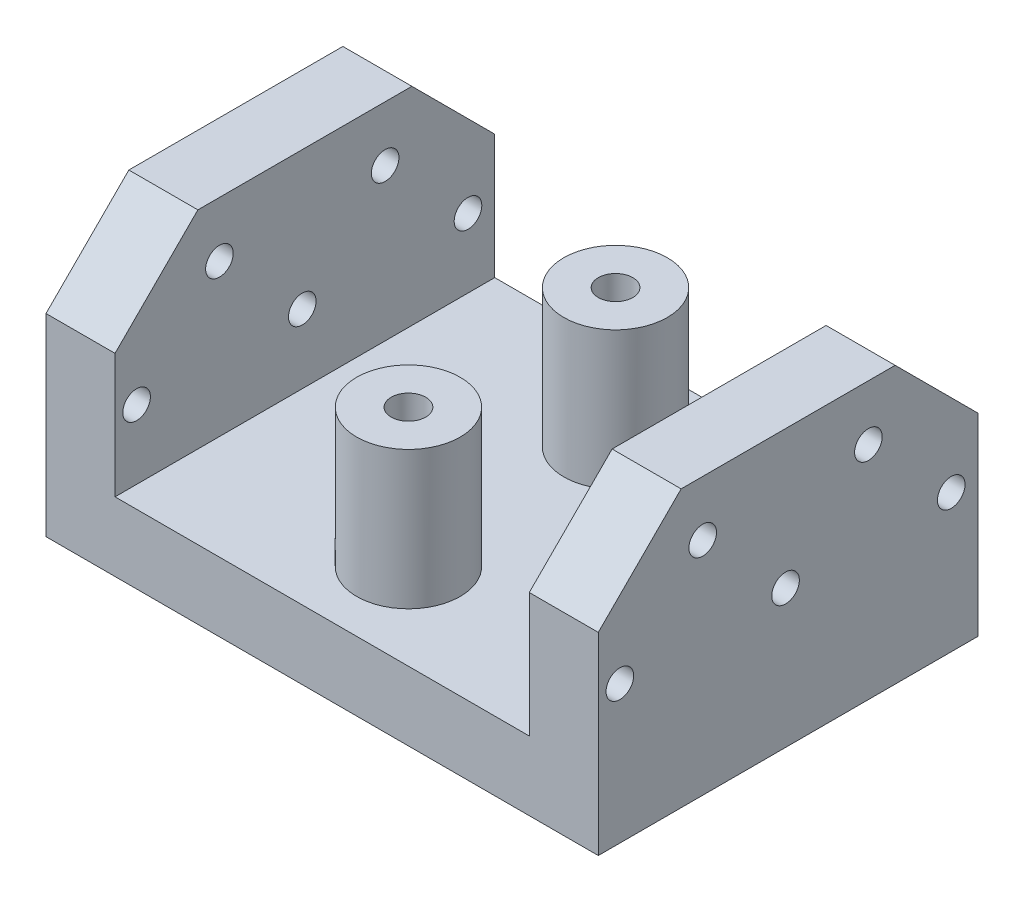
ISO-10303-21;
HEADER;
FILE_DESCRIPTION(('STEP AP214'),'2;1');
FILE_NAME('part.step','',(''),(''),'','','');
FILE_SCHEMA(('AUTOMOTIVE_DESIGN { 1 0 10303 214 1 1 1 1 }'));
ENDSEC;
DATA;
#1=APPLICATION_CONTEXT('core data for automotive mechanical design processes');
#2=APPLICATION_PROTOCOL_DEFINITION('international standard','automotive_design',2000,#1);
#3=PRODUCT_CONTEXT('',#1,'mechanical');
#4=PRODUCT('Part','Part','',(#3));
#5=PRODUCT_RELATED_PRODUCT_CATEGORY('part','',(#4));
#6=PRODUCT_DEFINITION_FORMATION('','',#4);
#7=PRODUCT_DEFINITION_CONTEXT('part definition',#1,'design');
#8=PRODUCT_DEFINITION('design','',#6,#7);
#9=PRODUCT_DEFINITION_SHAPE('','',#8);
#10=(LENGTH_UNIT() NAMED_UNIT(*) SI_UNIT(.MILLI.,.METRE.));
#11=(NAMED_UNIT(*) PLANE_ANGLE_UNIT() SI_UNIT($,.RADIAN.));
#12=(NAMED_UNIT(*) SI_UNIT($,.STERADIAN.) SOLID_ANGLE_UNIT());
#13=UNCERTAINTY_MEASURE_WITH_UNIT(LENGTH_MEASURE(1.E-05),#10,'distance_accuracy_value','');
#14=(GEOMETRIC_REPRESENTATION_CONTEXT(3) GLOBAL_UNCERTAINTY_ASSIGNED_CONTEXT((#13)) GLOBAL_UNIT_ASSIGNED_CONTEXT((#10,
#11,#12)) REPRESENTATION_CONTEXT('',''));
#15=CARTESIAN_POINT('',(0.,0.,0.));
#16=DIRECTION('',(0.,0.,1.));
#17=DIRECTION('',(1.,0.,0.));
#18=AXIS2_PLACEMENT_3D('',#15,#16,#17);
#19=CARTESIAN_POINT('',(0.,10.,0.));
#20=DIRECTION('',(0.,-1.,0.));
#21=DIRECTION('',(0.,0.,-1.));
#22=AXIS2_PLACEMENT_3D('',#19,#20,#21);
#23=PLANE('',#22);
#24=CARTESIAN_POINT('',(0.,10.,-15.));
#25=DIRECTION('',(0.,-1.,0.));
#26=DIRECTION('',(0.,0.,-1.));
#27=AXIS2_PLACEMENT_3D('',#24,#25,#26);
#28=CIRCLE('',#27,7.5);
#29=CARTESIAN_POINT('',(0.,10.,-22.5));
#30=VERTEX_POINT('',#29);
#31=EDGE_CURVE('E198',#30,#30,#28,.F.);
#32=ORIENTED_EDGE('',*,*,#31,.F.);
#33=EDGE_LOOP('',(#32));
#34=FACE_BOUND('',#33,.T.);
#35=DIRECTION('',(0.,0.,1.));
#36=VECTOR('',#35,1.);
#37=CARTESIAN_POINT('',(30.,10.,-27.5));
#38=LINE('',#37,#36);
#39=CARTESIAN_POINT('',(30.,10.,-27.5));
#40=VERTEX_POINT('',#39);
#41=CARTESIAN_POINT('',(30.,10.,27.5));
#42=VERTEX_POINT('',#41);
#43=EDGE_CURVE('E247',#40,#42,#38,.T.);
#44=ORIENTED_EDGE('',*,*,#43,.F.);
#45=DIRECTION('',(-1.,0.,0.));
#46=VECTOR('',#45,1.);
#47=CARTESIAN_POINT('',(-40.,10.,-27.5));
#48=LINE('',#47,#46);
#49=CARTESIAN_POINT('',(-30.,10.,-27.5));
#50=VERTEX_POINT('',#49);
#51=EDGE_CURVE('E271',#40,#50,#48,.T.);
#52=ORIENTED_EDGE('',*,*,#51,.T.);
#53=DIRECTION('',(0.,0.,-1.));
#54=VECTOR('',#53,1.);
#55=CARTESIAN_POINT('',(-30.,10.,-27.5));
#56=LINE('',#55,#54);
#57=CARTESIAN_POINT('',(-30.,10.,27.5));
#58=VERTEX_POINT('',#57);
#59=EDGE_CURVE('E259',#58,#50,#56,.T.);
#60=ORIENTED_EDGE('',*,*,#59,.F.);
#61=DIRECTION('',(1.,0.,0.));
#62=VECTOR('',#61,1.);
#63=CARTESIAN_POINT('',(-40.,10.,27.5));
#64=LINE('',#63,#62);
#65=EDGE_CURVE('E274',#58,#42,#64,.T.);
#66=ORIENTED_EDGE('',*,*,#65,.T.);
#67=EDGE_LOOP('',(#44,#52,#60,#66));
#68=FACE_BOUND('',#67,.T.);
#69=CARTESIAN_POINT('',(0.,10.,15.));
#70=DIRECTION('',(0.,-1.,0.));
#71=DIRECTION('',(0.,0.,-1.));
#72=AXIS2_PLACEMENT_3D('',#69,#70,#71);
#73=CIRCLE('',#72,7.5);
#74=CARTESIAN_POINT('',(0.,10.,7.5));
#75=VERTEX_POINT('',#74);
#76=EDGE_CURVE('E228',#75,#75,#73,.F.);
#77=ORIENTED_EDGE('',*,*,#76,.F.);
#78=EDGE_LOOP('',(#77));
#79=FACE_BOUND('',#78,.T.);
#80=ADVANCED_FACE('F37',(#34,#68,#79),#23,.F.);
#81=CARTESIAN_POINT('',(40.,10.,27.5));
#82=DIRECTION('',(-1.,0.,0.));
#83=DIRECTION('',(0.,0.,1.));
#84=AXIS2_PLACEMENT_3D('',#81,#82,#83);
#85=PLANE('',#84);
#86=CARTESIAN_POINT('',(40.,20.,0.3758071990035));
#87=DIRECTION('',(-1.,0.,0.));
#88=DIRECTION('',(0.,0.,1.));
#89=AXIS2_PLACEMENT_3D('',#86,#87,#88);
#90=CIRCLE('',#89,2.);
#91=CARTESIAN_POINT('',(40.,20.,2.3758071990035));
#92=VERTEX_POINT('',#91);
#93=EDGE_CURVE('E213',#92,#92,#90,.T.);
#94=ORIENTED_EDGE('',*,*,#93,.T.);
#95=EDGE_LOOP('',(#94));
#96=FACE_BOUND('',#95,.T.);
#97=CARTESIAN_POINT('',(40.,20.,24.3758071990035));
#98=DIRECTION('',(-1.,0.,0.));
#99=DIRECTION('',(0.,0.,1.));
#100=AXIS2_PLACEMENT_3D('',#97,#98,#99);
#101=CIRCLE('',#100,2.);
#102=CARTESIAN_POINT('',(40.,20.,26.3758071990035));
#103=VERTEX_POINT('',#102);
#104=EDGE_CURVE('E400',#103,#103,#101,.T.);
#105=ORIENTED_EDGE('',*,*,#104,.T.);
#106=EDGE_LOOP('',(#105));
#107=FACE_BOUND('',#106,.T.);
#108=CARTESIAN_POINT('',(40.,32.,-11.6241928009965));
#109=DIRECTION('',(-1.,0.,0.));
#110=DIRECTION('',(0.,0.,1.));
#111=AXIS2_PLACEMENT_3D('',#108,#109,#110);
#112=CIRCLE('',#111,2.);
#113=CARTESIAN_POINT('',(40.,32.,-9.6241928009965));
#114=VERTEX_POINT('',#113);
#115=EDGE_CURVE('E406',#114,#114,#112,.T.);
#116=ORIENTED_EDGE('',*,*,#115,.T.);
#117=EDGE_LOOP('',(#116));
#118=FACE_BOUND('',#117,.T.);
#119=CARTESIAN_POINT('',(40.,32.,12.3758071990035));
#120=DIRECTION('',(-1.,0.,0.));
#121=DIRECTION('',(0.,0.,1.));
#122=AXIS2_PLACEMENT_3D('',#119,#120,#121);
#123=CIRCLE('',#122,2.);
#124=CARTESIAN_POINT('',(40.,32.,14.3758071990035));
#125=VERTEX_POINT('',#124);
#126=EDGE_CURVE('E412',#125,#125,#123,.T.);
#127=ORIENTED_EDGE('',*,*,#126,.T.);
#128=EDGE_LOOP('',(#127));
#129=FACE_BOUND('',#128,.T.);
#130=CARTESIAN_POINT('',(40.,20.,-23.6241928009965));
#131=DIRECTION('',(-1.,0.,0.));
#132=DIRECTION('',(0.,0.,1.));
#133=AXIS2_PLACEMENT_3D('',#130,#131,#132);
#134=CIRCLE('',#133,2.);
#135=CARTESIAN_POINT('',(40.,20.,-21.6241928009965));
#136=VERTEX_POINT('',#135);
#137=EDGE_CURVE('E208',#136,#136,#134,.T.);
#138=ORIENTED_EDGE('',*,*,#137,.T.);
#139=EDGE_LOOP('',(#138));
#140=FACE_BOUND('',#139,.T.);
#141=DIRECTION('',(0.,-1.,0.));
#142=VECTOR('',#141,1.);
#143=CARTESIAN_POINT('',(40.,10.,-27.5));
#144=LINE('',#143,#142);
#145=CARTESIAN_POINT('',(40.,28.,-27.5));
#146=VERTEX_POINT('',#145);
#147=CARTESIAN_POINT('',(40.,0.,-27.5));
#148=VERTEX_POINT('',#147);
#149=EDGE_CURVE('E195',#146,#148,#144,.T.);
#150=ORIENTED_EDGE('',*,*,#149,.F.);
#151=DIRECTION('',(0.,-0.707106781186548,-0.707106781186548));
#152=VECTOR('',#151,1.);
#153=CARTESIAN_POINT('',(40.,40.,-15.5));
#154=LINE('',#153,#152);
#155=CARTESIAN_POINT('',(40.,40.,-15.5));
#156=VERTEX_POINT('',#155);
#157=EDGE_CURVE('E189',#156,#146,#154,.T.);
#158=ORIENTED_EDGE('',*,*,#157,.F.);
#159=DIRECTION('',(0.,0.,-1.));
#160=VECTOR('',#159,1.);
#161=CARTESIAN_POINT('',(40.,40.,-27.5));
#162=LINE('',#161,#160);
#163=CARTESIAN_POINT('',(40.,40.,15.5));
#164=VERTEX_POINT('',#163);
#165=EDGE_CURVE('E236',#164,#156,#162,.T.);
#166=ORIENTED_EDGE('',*,*,#165,.F.);
#167=DIRECTION('',(0.,0.707106781186548,-0.707106781186548));
#168=VECTOR('',#167,1.);
#169=CARTESIAN_POINT('',(40.,28.,27.5));
#170=LINE('',#169,#168);
#171=CARTESIAN_POINT('',(40.,28.,27.5));
#172=VERTEX_POINT('',#171);
#173=EDGE_CURVE('E245',#172,#164,#170,.T.);
#174=ORIENTED_EDGE('',*,*,#173,.F.);
#175=DIRECTION('',(0.,-1.,0.));
#176=VECTOR('',#175,1.);
#177=CARTESIAN_POINT('',(40.,10.,27.5));
#178=LINE('',#177,#176);
#179=CARTESIAN_POINT('',(40.,0.,27.5));
#180=VERTEX_POINT('',#179);
#181=EDGE_CURVE('E200',#172,#180,#178,.T.);
#182=ORIENTED_EDGE('',*,*,#181,.T.);
#183=DIRECTION('',(0.,0.,-1.));
#184=VECTOR('',#183,1.);
#185=CARTESIAN_POINT('',(40.,0.,27.5));
#186=LINE('',#185,#184);
#187=EDGE_CURVE('E270',#180,#148,#186,.T.);
#188=ORIENTED_EDGE('',*,*,#187,.T.);
#189=EDGE_LOOP('',(#150,#158,#166,#174,#182,#188));
#190=FACE_BOUND('',#189,.T.);
#191=ADVANCED_FACE('F39',(#96,#107,#118,#129,#140,#190),#85,.F.);
#192=CARTESIAN_POINT('',(-40.,10.,-27.5));
#193=DIRECTION('',(0.,0.,1.));
#194=DIRECTION('',(1.,0.,0.));
#195=AXIS2_PLACEMENT_3D('',#192,#193,#194);
#196=PLANE('',#195);
#197=DIRECTION('',(0.,-1.,0.));
#198=VECTOR('',#197,1.);
#199=CARTESIAN_POINT('',(-40.,10.,-27.5));
#200=LINE('',#199,#198);
#201=CARTESIAN_POINT('',(-40.,28.,-27.5));
#202=VERTEX_POINT('',#201);
#203=CARTESIAN_POINT('',(-40.,0.,-27.5));
#204=VERTEX_POINT('',#203);
#205=EDGE_CURVE('E184',#202,#204,#200,.T.);
#206=ORIENTED_EDGE('',*,*,#205,.F.);
#207=DIRECTION('',(1.,0.,0.));
#208=VECTOR('',#207,1.);
#209=CARTESIAN_POINT('',(-40.,28.,-27.5));
#210=LINE('',#209,#208);
#211=CARTESIAN_POINT('',(-30.,28.,-27.5));
#212=VERTEX_POINT('',#211);
#213=EDGE_CURVE('E171',#202,#212,#210,.T.);
#214=ORIENTED_EDGE('',*,*,#213,.T.);
#215=DIRECTION('',(0.,-1.,0.));
#216=VECTOR('',#215,1.);
#217=CARTESIAN_POINT('',(-30.,40.,-27.5));
#218=LINE('',#217,#216);
#219=EDGE_CURVE('E264',#212,#50,#218,.T.);
#220=ORIENTED_EDGE('',*,*,#219,.T.);
#221=ORIENTED_EDGE('',*,*,#51,.F.);
#222=DIRECTION('',(0.,-1.,0.));
#223=VECTOR('',#222,1.);
#224=CARTESIAN_POINT('',(30.,40.,-27.5));
#225=LINE('',#224,#223);
#226=CARTESIAN_POINT('',(30.,28.,-27.5));
#227=VERTEX_POINT('',#226);
#228=EDGE_CURVE('E257',#227,#40,#225,.T.);
#229=ORIENTED_EDGE('',*,*,#228,.F.);
#230=EDGE_CURVE('E178',#227,#146,#210,.T.);
#231=ORIENTED_EDGE('',*,*,#230,.T.);
#232=ORIENTED_EDGE('',*,*,#149,.T.);
#233=DIRECTION('',(-1.,0.,0.));
#234=VECTOR('',#233,1.);
#235=CARTESIAN_POINT('',(-40.,0.,-27.5));
#236=LINE('',#235,#234);
#237=EDGE_CURVE('E193',#148,#204,#236,.T.);
#238=ORIENTED_EDGE('',*,*,#237,.T.);
#239=EDGE_LOOP('',(#206,#214,#220,#221,#229,#231,#232,#238));
#240=FACE_BOUND('',#239,.T.);
#241=ADVANCED_FACE('F191',(#240),#196,.F.);
#242=CARTESIAN_POINT('',(-40.,10.,27.5));
#243=DIRECTION('',(1.,0.,0.));
#244=DIRECTION('',(0.,0.,-1.));
#245=AXIS2_PLACEMENT_3D('',#242,#243,#244);
#246=PLANE('',#245);
#247=CARTESIAN_POINT('',(-40.,20.,0.3758071990035));
#248=DIRECTION('',(-1.,0.,0.));
#249=DIRECTION('',(0.,0.,1.));
#250=AXIS2_PLACEMENT_3D('',#247,#248,#249);
#251=CIRCLE('',#250,2.);
#252=CARTESIAN_POINT('',(-40.,20.,2.3758071990035));
#253=VERTEX_POINT('',#252);
#254=EDGE_CURVE('E397',#253,#253,#251,.T.);
#255=ORIENTED_EDGE('',*,*,#254,.F.);
#256=EDGE_LOOP('',(#255));
#257=FACE_BOUND('',#256,.T.);
#258=CARTESIAN_POINT('',(-40.,20.,24.3758071990035));
#259=DIRECTION('',(-1.,0.,0.));
#260=DIRECTION('',(0.,0.,1.));
#261=AXIS2_PLACEMENT_3D('',#258,#259,#260);
#262=CIRCLE('',#261,2.);
#263=CARTESIAN_POINT('',(-40.,20.,26.3758071990035));
#264=VERTEX_POINT('',#263);
#265=EDGE_CURVE('E403',#264,#264,#262,.T.);
#266=ORIENTED_EDGE('',*,*,#265,.F.);
#267=EDGE_LOOP('',(#266));
#268=FACE_BOUND('',#267,.T.);
#269=CARTESIAN_POINT('',(-40.,32.,-11.6241928009965));
#270=DIRECTION('',(-1.,0.,0.));
#271=DIRECTION('',(0.,0.,1.));
#272=AXIS2_PLACEMENT_3D('',#269,#270,#271);
#273=CIRCLE('',#272,2.);
#274=CARTESIAN_POINT('',(-40.,32.,-9.6241928009965));
#275=VERTEX_POINT('',#274);
#276=EDGE_CURVE('E409',#275,#275,#273,.T.);
#277=ORIENTED_EDGE('',*,*,#276,.F.);
#278=EDGE_LOOP('',(#277));
#279=FACE_BOUND('',#278,.T.);
#280=CARTESIAN_POINT('',(-40.,32.,12.3758071990035));
#281=DIRECTION('',(-1.,0.,0.));
#282=DIRECTION('',(0.,0.,1.));
#283=AXIS2_PLACEMENT_3D('',#280,#281,#282);
#284=CIRCLE('',#283,2.);
#285=CARTESIAN_POINT('',(-40.,32.,14.3758071990035));
#286=VERTEX_POINT('',#285);
#287=EDGE_CURVE('E394',#286,#286,#284,.T.);
#288=ORIENTED_EDGE('',*,*,#287,.F.);
#289=EDGE_LOOP('',(#288));
#290=FACE_BOUND('',#289,.T.);
#291=CARTESIAN_POINT('',(-40.,20.,-23.6241928009965));
#292=DIRECTION('',(-1.,0.,0.));
#293=DIRECTION('',(0.,0.,1.));
#294=AXIS2_PLACEMENT_3D('',#291,#292,#293);
#295=CIRCLE('',#294,2.);
#296=CARTESIAN_POINT('',(-40.,20.,-21.6241928009965));
#297=VERTEX_POINT('',#296);
#298=EDGE_CURVE('E425',#297,#297,#295,.T.);
#299=ORIENTED_EDGE('',*,*,#298,.F.);
#300=EDGE_LOOP('',(#299));
#301=FACE_BOUND('',#300,.T.);
#302=DIRECTION('',(0.,0.,1.));
#303=VECTOR('',#302,1.);
#304=CARTESIAN_POINT('',(-40.,40.,-27.5));
#305=LINE('',#304,#303);
#306=CARTESIAN_POINT('',(-40.,40.,-15.5));
#307=VERTEX_POINT('',#306);
#308=CARTESIAN_POINT('',(-40.,40.,15.5));
#309=VERTEX_POINT('',#308);
#310=EDGE_CURVE('E187',#307,#309,#305,.T.);
#311=ORIENTED_EDGE('',*,*,#310,.F.);
#312=DIRECTION('',(0.,-0.707106781186548,-0.707106781186548));
#313=VECTOR('',#312,1.);
#314=CARTESIAN_POINT('',(-40.,40.,-15.5));
#315=LINE('',#314,#313);
#316=EDGE_CURVE('E52',#307,#202,#315,.T.);
#317=ORIENTED_EDGE('',*,*,#316,.T.);
#318=ORIENTED_EDGE('',*,*,#205,.T.);
#319=DIRECTION('',(0.,0.,1.));
#320=VECTOR('',#319,1.);
#321=CARTESIAN_POINT('',(-40.,0.,27.5));
#322=LINE('',#321,#320);
#323=CARTESIAN_POINT('',(-40.,0.,27.5));
#324=VERTEX_POINT('',#323);
#325=EDGE_CURVE('E281',#204,#324,#322,.T.);
#326=ORIENTED_EDGE('',*,*,#325,.T.);
#327=DIRECTION('',(0.,-1.,0.));
#328=VECTOR('',#327,1.);
#329=CARTESIAN_POINT('',(-40.,10.,27.5));
#330=LINE('',#329,#328);
#331=CARTESIAN_POINT('',(-40.,28.,27.5));
#332=VERTEX_POINT('',#331);
#333=EDGE_CURVE('E196',#332,#324,#330,.T.);
#334=ORIENTED_EDGE('',*,*,#333,.F.);
#335=DIRECTION('',(0.,0.707106781186548,-0.707106781186548));
#336=VECTOR('',#335,1.);
#337=CARTESIAN_POINT('',(-40.,28.,27.5));
#338=LINE('',#337,#336);
#339=EDGE_CURVE('E293',#332,#309,#338,.T.);
#340=ORIENTED_EDGE('',*,*,#339,.T.);
#341=EDGE_LOOP('',(#311,#317,#318,#326,#334,#340));
#342=FACE_BOUND('',#341,.T.);
#343=ADVANCED_FACE('F182',(#257,#268,#279,#290,#301,#342),#246,.F.);
#344=CARTESIAN_POINT('',(-40.,10.,27.5));
#345=DIRECTION('',(0.,0.,-1.));
#346=DIRECTION('',(-1.,0.,0.));
#347=AXIS2_PLACEMENT_3D('',#344,#345,#346);
#348=PLANE('',#347);
#349=ORIENTED_EDGE('',*,*,#181,.F.);
#350=DIRECTION('',(1.,0.,0.));
#351=VECTOR('',#350,1.);
#352=CARTESIAN_POINT('',(-40.,28.,27.5));
#353=LINE('',#352,#351);
#354=CARTESIAN_POINT('',(30.,28.,27.5));
#355=VERTEX_POINT('',#354);
#356=EDGE_CURVE('E296',#355,#172,#353,.T.);
#357=ORIENTED_EDGE('',*,*,#356,.F.);
#358=DIRECTION('',(0.,-1.,0.));
#359=VECTOR('',#358,1.);
#360=CARTESIAN_POINT('',(30.,40.,27.5));
#361=LINE('',#360,#359);
#362=EDGE_CURVE('E249',#355,#42,#361,.T.);
#363=ORIENTED_EDGE('',*,*,#362,.T.);
#364=ORIENTED_EDGE('',*,*,#65,.F.);
#365=DIRECTION('',(0.,-1.,0.));
#366=VECTOR('',#365,1.);
#367=CARTESIAN_POINT('',(-30.,40.,27.5));
#368=LINE('',#367,#366);
#369=CARTESIAN_POINT('',(-30.,28.,27.5));
#370=VERTEX_POINT('',#369);
#371=EDGE_CURVE('E268',#370,#58,#368,.T.);
#372=ORIENTED_EDGE('',*,*,#371,.F.);
#373=EDGE_CURVE('E298',#332,#370,#353,.T.);
#374=ORIENTED_EDGE('',*,*,#373,.F.);
#375=ORIENTED_EDGE('',*,*,#333,.T.);
#376=DIRECTION('',(1.,0.,0.));
#377=VECTOR('',#376,1.);
#378=CARTESIAN_POINT('',(-40.,0.,27.5));
#379=LINE('',#378,#377);
#380=EDGE_CURVE('E275',#324,#180,#379,.T.);
#381=ORIENTED_EDGE('',*,*,#380,.T.);
#382=EDGE_LOOP('',(#349,#357,#363,#364,#372,#374,#375,#381));
#383=FACE_BOUND('',#382,.T.);
#384=ADVANCED_FACE('F288',(#383),#348,.F.);
#385=CARTESIAN_POINT('',(0.,0.,0.));
#386=DIRECTION('',(0.,-1.,0.));
#387=DIRECTION('',(0.,0.,-1.));
#388=AXIS2_PLACEMENT_3D('',#385,#386,#387);
#389=PLANE('',#388);
#390=DIRECTION('',(0.,0.,-1.));
#391=VECTOR('',#390,1.);
#392=CARTESIAN_POINT('',(-10.25,0.,-10.75));
#393=LINE('',#392,#391);
#394=CARTESIAN_POINT('',(-10.25,0.,-7.5));
#395=VERTEX_POINT('',#394);
#396=CARTESIAN_POINT('',(-10.25,0.,-10.75));
#397=VERTEX_POINT('',#396);
#398=EDGE_CURVE('E312',#395,#397,#393,.T.);
#399=ORIENTED_EDGE('',*,*,#398,.F.);
#400=DIRECTION('',(-1.,0.,0.));
#401=VECTOR('',#400,1.);
#402=CARTESIAN_POINT('',(-10.25,0.,-7.5));
#403=LINE('',#402,#401);
#404=CARTESIAN_POINT('',(10.25,0.,-7.5));
#405=VERTEX_POINT('',#404);
#406=EDGE_CURVE('E317',#405,#395,#403,.T.);
#407=ORIENTED_EDGE('',*,*,#406,.F.);
#408=DIRECTION('',(0.,0.,1.));
#409=VECTOR('',#408,1.);
#410=CARTESIAN_POINT('',(10.25,0.,-7.5));
#411=LINE('',#410,#409);
#412=CARTESIAN_POINT('',(10.25,0.,-10.75));
#413=VERTEX_POINT('',#412);
#414=EDGE_CURVE('E331',#413,#405,#411,.T.);
#415=ORIENTED_EDGE('',*,*,#414,.F.);
#416=DIRECTION('',(1.,0.,0.));
#417=VECTOR('',#416,1.);
#418=CARTESIAN_POINT('',(-10.25,0.,-10.75));
#419=LINE('',#418,#417);
#420=EDGE_CURVE('E328',#397,#413,#419,.T.);
#421=ORIENTED_EDGE('',*,*,#420,.F.);
#422=EDGE_LOOP('',(#399,#407,#415,#421));
#423=FACE_BOUND('',#422,.T.);
#424=DIRECTION('',(0.,0.,-1.));
#425=VECTOR('',#424,1.);
#426=CARTESIAN_POINT('',(-10.25,0.,10.75));
#427=LINE('',#426,#425);
#428=CARTESIAN_POINT('',(-10.25,0.,10.75));
#429=VERTEX_POINT('',#428);
#430=CARTESIAN_POINT('',(-10.25,0.,7.5));
#431=VERTEX_POINT('',#430);
#432=EDGE_CURVE('E338',#429,#431,#427,.T.);
#433=ORIENTED_EDGE('',*,*,#432,.F.);
#434=DIRECTION('',(-1.,0.,0.));
#435=VECTOR('',#434,1.);
#436=CARTESIAN_POINT('',(-10.25,0.,10.75));
#437=LINE('',#436,#435);
#438=CARTESIAN_POINT('',(10.25,0.,10.75));
#439=VERTEX_POINT('',#438);
#440=EDGE_CURVE('E349',#439,#429,#437,.T.);
#441=ORIENTED_EDGE('',*,*,#440,.F.);
#442=DIRECTION('',(0.,0.,1.));
#443=VECTOR('',#442,1.);
#444=CARTESIAN_POINT('',(10.25,0.,7.5));
#445=LINE('',#444,#443);
#446=CARTESIAN_POINT('',(10.25,0.,7.5));
#447=VERTEX_POINT('',#446);
#448=EDGE_CURVE('E363',#447,#439,#445,.T.);
#449=ORIENTED_EDGE('',*,*,#448,.F.);
#450=DIRECTION('',(1.,0.,0.));
#451=VECTOR('',#450,1.);
#452=CARTESIAN_POINT('',(-10.25,0.,7.5));
#453=LINE('',#452,#451);
#454=EDGE_CURVE('E360',#431,#447,#453,.T.);
#455=ORIENTED_EDGE('',*,*,#454,.F.);
#456=EDGE_LOOP('',(#433,#441,#449,#455));
#457=FACE_BOUND('',#456,.T.);
#458=CARTESIAN_POINT('',(0.,0.,-15.));
#459=DIRECTION('',(0.,-1.,0.));
#460=DIRECTION('',(0.,0.,-1.));
#461=AXIS2_PLACEMENT_3D('',#458,#459,#460);
#462=CIRCLE('',#461,2.5);
#463=CARTESIAN_POINT('',(0.,0.,-17.5));
#464=VERTEX_POINT('',#463);
#465=EDGE_CURVE('E388',#464,#464,#462,.T.);
#466=ORIENTED_EDGE('',*,*,#465,.F.);
#467=EDGE_LOOP('',(#466));
#468=FACE_BOUND('',#467,.T.);
#469=CARTESIAN_POINT('',(0.,0.,15.));
#470=DIRECTION('',(0.,-1.,0.));
#471=DIRECTION('',(0.,0.,-1.));
#472=AXIS2_PLACEMENT_3D('',#469,#470,#471);
#473=CIRCLE('',#472,2.5);
#474=CARTESIAN_POINT('',(0.,0.,12.5));
#475=VERTEX_POINT('',#474);
#476=EDGE_CURVE('E391',#475,#475,#473,.T.);
#477=ORIENTED_EDGE('',*,*,#476,.F.);
#478=EDGE_LOOP('',(#477));
#479=FACE_BOUND('',#478,.T.);
#480=ORIENTED_EDGE('',*,*,#187,.F.);
#481=ORIENTED_EDGE('',*,*,#380,.F.);
#482=ORIENTED_EDGE('',*,*,#325,.F.);
#483=ORIENTED_EDGE('',*,*,#237,.F.);
#484=EDGE_LOOP('',(#480,#481,#482,#483));
#485=FACE_BOUND('',#484,.T.);
#486=ADVANCED_FACE('F292',(#423,#457,#468,#479,#485),#389,.T.);
#487=CARTESIAN_POINT('',(-30.,40.,-27.5));
#488=DIRECTION('',(-1.,0.,0.));
#489=DIRECTION('',(0.,0.,1.));
#490=AXIS2_PLACEMENT_3D('',#487,#488,#489);
#491=PLANE('',#490);
#492=CARTESIAN_POINT('',(-30.,20.,0.3758071990035));
#493=DIRECTION('',(-1.,0.,0.));
#494=DIRECTION('',(0.,0.,1.));
#495=AXIS2_PLACEMENT_3D('',#492,#493,#494);
#496=CIRCLE('',#495,2.);
#497=CARTESIAN_POINT('',(-30.,20.,2.3758071990035));
#498=VERTEX_POINT('',#497);
#499=EDGE_CURVE('E225',#498,#498,#496,.T.);
#500=ORIENTED_EDGE('',*,*,#499,.T.);
#501=EDGE_LOOP('',(#500));
#502=FACE_BOUND('',#501,.T.);
#503=CARTESIAN_POINT('',(-30.,20.,24.3758071990035));
#504=DIRECTION('',(-1.,0.,0.));
#505=DIRECTION('',(0.,0.,1.));
#506=AXIS2_PLACEMENT_3D('',#503,#504,#505);
#507=CIRCLE('',#506,2.);
#508=CARTESIAN_POINT('',(-30.,20.,26.3758071990035));
#509=VERTEX_POINT('',#508);
#510=EDGE_CURVE('E221',#509,#509,#507,.T.);
#511=ORIENTED_EDGE('',*,*,#510,.T.);
#512=EDGE_LOOP('',(#511));
#513=FACE_BOUND('',#512,.T.);
#514=CARTESIAN_POINT('',(-30.,32.,-11.6241928009965));
#515=DIRECTION('',(-1.,0.,0.));
#516=DIRECTION('',(0.,0.,1.));
#517=AXIS2_PLACEMENT_3D('',#514,#515,#516);
#518=CIRCLE('',#517,2.);
#519=CARTESIAN_POINT('',(-30.,32.,-9.6241928009965));
#520=VERTEX_POINT('',#519);
#521=EDGE_CURVE('E217',#520,#520,#518,.T.);
#522=ORIENTED_EDGE('',*,*,#521,.T.);
#523=EDGE_LOOP('',(#522));
#524=FACE_BOUND('',#523,.T.);
#525=CARTESIAN_POINT('',(-30.,32.,12.3758071990035));
#526=DIRECTION('',(-1.,0.,0.));
#527=DIRECTION('',(0.,0.,1.));
#528=AXIS2_PLACEMENT_3D('',#525,#526,#527);
#529=CIRCLE('',#528,2.);
#530=CARTESIAN_POINT('',(-30.,32.,14.3758071990035));
#531=VERTEX_POINT('',#530);
#532=EDGE_CURVE('E212',#531,#531,#529,.T.);
#533=ORIENTED_EDGE('',*,*,#532,.T.);
#534=EDGE_LOOP('',(#533));
#535=FACE_BOUND('',#534,.T.);
#536=CARTESIAN_POINT('',(-30.,20.,-23.6241928009965));
#537=DIRECTION('',(-1.,0.,0.));
#538=DIRECTION('',(0.,0.,1.));
#539=AXIS2_PLACEMENT_3D('',#536,#537,#538);
#540=CIRCLE('',#539,2.);
#541=CARTESIAN_POINT('',(-30.,20.,-21.6241928009965));
#542=VERTEX_POINT('',#541);
#543=EDGE_CURVE('E207',#542,#542,#540,.T.);
#544=ORIENTED_EDGE('',*,*,#543,.T.);
#545=EDGE_LOOP('',(#544));
#546=FACE_BOUND('',#545,.T.);
#547=ORIENTED_EDGE('',*,*,#219,.F.);
#548=DIRECTION('',(0.,0.707106781186548,0.707106781186548));
#549=VECTOR('',#548,1.);
#550=CARTESIAN_POINT('',(-30.,34.,-21.5));
#551=LINE('',#550,#549);
#552=CARTESIAN_POINT('',(-30.,40.,-15.5));
#553=VERTEX_POINT('',#552);
#554=EDGE_CURVE('E174',#212,#553,#551,.T.);
#555=ORIENTED_EDGE('',*,*,#554,.T.);
#556=DIRECTION('',(0.,0.,-1.));
#557=VECTOR('',#556,1.);
#558=CARTESIAN_POINT('',(-30.,40.,-27.5));
#559=LINE('',#558,#557);
#560=CARTESIAN_POINT('',(-30.,40.,15.5));
#561=VERTEX_POINT('',#560);
#562=EDGE_CURVE('E261',#561,#553,#559,.T.);
#563=ORIENTED_EDGE('',*,*,#562,.F.);
#564=DIRECTION('',(0.,-0.707106781186548,0.707106781186548));
#565=VECTOR('',#564,1.);
#566=CARTESIAN_POINT('',(-30.,61.5,-6.00000000000002));
#567=LINE('',#566,#565);
#568=EDGE_CURVE('E309',#561,#370,#567,.T.);
#569=ORIENTED_EDGE('',*,*,#568,.T.);
#570=ORIENTED_EDGE('',*,*,#371,.T.);
#571=ORIENTED_EDGE('',*,*,#59,.T.);
#572=EDGE_LOOP('',(#547,#555,#563,#569,#570,#571));
#573=FACE_BOUND('',#572,.T.);
#574=ADVANCED_FACE('F454',(#502,#513,#524,#535,#546,#573),#491,.F.);
#575=CARTESIAN_POINT('',(0.,40.,0.));
#576=DIRECTION('',(0.,1.,0.));
#577=DIRECTION('',(0.,0.,1.));
#578=AXIS2_PLACEMENT_3D('',#575,#576,#577);
#579=PLANE('',#578);
#580=DIRECTION('',(1.,0.,0.));
#581=VECTOR('',#580,1.);
#582=CARTESIAN_POINT('',(-40.,40.,-15.5));
#583=LINE('',#582,#581);
#584=EDGE_CURVE('E188',#307,#553,#583,.T.);
#585=ORIENTED_EDGE('',*,*,#584,.F.);
#586=ORIENTED_EDGE('',*,*,#310,.T.);
#587=DIRECTION('',(1.,0.,0.));
#588=VECTOR('',#587,1.);
#589=CARTESIAN_POINT('',(-40.,40.,15.5));
#590=LINE('',#589,#588);
#591=EDGE_CURVE('E304',#309,#561,#590,.T.);
#592=ORIENTED_EDGE('',*,*,#591,.T.);
#593=ORIENTED_EDGE('',*,*,#562,.T.);
#594=EDGE_LOOP('',(#585,#586,#592,#593));
#595=FACE_BOUND('',#594,.T.);
#596=ADVANCED_FACE('F461',(#595),#579,.T.);
#597=CARTESIAN_POINT('',(30.,40.,-27.5));
#598=DIRECTION('',(1.,0.,0.));
#599=DIRECTION('',(0.,0.,-1.));
#600=AXIS2_PLACEMENT_3D('',#597,#598,#599);
#601=PLANE('',#600);
#602=CARTESIAN_POINT('',(30.,20.,0.3758071990035));
#603=DIRECTION('',(1.,0.,0.));
#604=DIRECTION('',(0.,0.,-1.));
#605=AXIS2_PLACEMENT_3D('',#602,#603,#604);
#606=CIRCLE('',#605,2.);
#607=CARTESIAN_POINT('',(30.,20.,-1.6241928009965));
#608=VERTEX_POINT('',#607);
#609=EDGE_CURVE('E222',#608,#608,#606,.T.);
#610=ORIENTED_EDGE('',*,*,#609,.T.);
#611=EDGE_LOOP('',(#610));
#612=FACE_BOUND('',#611,.T.);
#613=CARTESIAN_POINT('',(30.,20.,24.3758071990035));
#614=DIRECTION('',(1.,0.,0.));
#615=DIRECTION('',(0.,0.,-1.));
#616=AXIS2_PLACEMENT_3D('',#613,#614,#615);
#617=CIRCLE('',#616,2.);
#618=CARTESIAN_POINT('',(30.,20.,22.3758071990035));
#619=VERTEX_POINT('',#618);
#620=EDGE_CURVE('E218',#619,#619,#617,.T.);
#621=ORIENTED_EDGE('',*,*,#620,.T.);
#622=EDGE_LOOP('',(#621));
#623=FACE_BOUND('',#622,.T.);
#624=CARTESIAN_POINT('',(30.,32.,-11.6241928009965));
#625=DIRECTION('',(1.,0.,0.));
#626=DIRECTION('',(0.,0.,-1.));
#627=AXIS2_PLACEMENT_3D('',#624,#625,#626);
#628=CIRCLE('',#627,2.);
#629=CARTESIAN_POINT('',(30.,32.,-13.6241928009965));
#630=VERTEX_POINT('',#629);
#631=EDGE_CURVE('E214',#630,#630,#628,.T.);
#632=ORIENTED_EDGE('',*,*,#631,.T.);
#633=EDGE_LOOP('',(#632));
#634=FACE_BOUND('',#633,.T.);
#635=CARTESIAN_POINT('',(30.,32.,12.3758071990035));
#636=DIRECTION('',(1.,0.,0.));
#637=DIRECTION('',(0.,0.,-1.));
#638=AXIS2_PLACEMENT_3D('',#635,#636,#637);
#639=CIRCLE('',#638,2.);
#640=CARTESIAN_POINT('',(30.,32.,10.3758071990035));
#641=VERTEX_POINT('',#640);
#642=EDGE_CURVE('E209',#641,#641,#639,.T.);
#643=ORIENTED_EDGE('',*,*,#642,.T.);
#644=EDGE_LOOP('',(#643));
#645=FACE_BOUND('',#644,.T.);
#646=CARTESIAN_POINT('',(30.,20.,-23.6241928009965));
#647=DIRECTION('',(1.,0.,0.));
#648=DIRECTION('',(0.,0.,-1.));
#649=AXIS2_PLACEMENT_3D('',#646,#647,#648);
#650=CIRCLE('',#649,2.);
#651=CARTESIAN_POINT('',(30.,20.,-25.6241928009965));
#652=VERTEX_POINT('',#651);
#653=EDGE_CURVE('E204',#652,#652,#650,.T.);
#654=ORIENTED_EDGE('',*,*,#653,.T.);
#655=EDGE_LOOP('',(#654));
#656=FACE_BOUND('',#655,.T.);
#657=DIRECTION('',(0.,0.,1.));
#658=VECTOR('',#657,1.);
#659=CARTESIAN_POINT('',(30.,40.,-27.5));
#660=LINE('',#659,#658);
#661=CARTESIAN_POINT('',(30.,40.,-15.5));
#662=VERTEX_POINT('',#661);
#663=CARTESIAN_POINT('',(30.,40.,15.5));
#664=VERTEX_POINT('',#663);
#665=EDGE_CURVE('E238',#662,#664,#660,.T.);
#666=ORIENTED_EDGE('',*,*,#665,.F.);
#667=DIRECTION('',(0.,-0.707106781186548,-0.707106781186548));
#668=VECTOR('',#667,1.);
#669=CARTESIAN_POINT('',(30.,34.,-21.5));
#670=LINE('',#669,#668);
#671=EDGE_CURVE('E60',#662,#227,#670,.T.);
#672=ORIENTED_EDGE('',*,*,#671,.T.);
#673=ORIENTED_EDGE('',*,*,#228,.T.);
#674=ORIENTED_EDGE('',*,*,#43,.T.);
#675=ORIENTED_EDGE('',*,*,#362,.F.);
#676=DIRECTION('',(0.,0.707106781186548,-0.707106781186548));
#677=VECTOR('',#676,1.);
#678=CARTESIAN_POINT('',(30.,61.5,-6.00000000000002));
#679=LINE('',#678,#677);
#680=EDGE_CURVE('E306',#355,#664,#679,.T.);
#681=ORIENTED_EDGE('',*,*,#680,.T.);
#682=EDGE_LOOP('',(#666,#672,#673,#674,#675,#681));
#683=FACE_BOUND('',#682,.T.);
#684=ADVANCED_FACE('F532',(#612,#623,#634,#645,#656,#683),#601,.F.);
#685=CARTESIAN_POINT('',(0.,40.,0.));
#686=DIRECTION('',(0.,-1.,0.));
#687=DIRECTION('',(0.,0.,-1.));
#688=AXIS2_PLACEMENT_3D('',#685,#686,#687);
#689=PLANE('',#688);
#690=ORIENTED_EDGE('',*,*,#165,.T.);
#691=DIRECTION('',(-1.,0.,0.));
#692=VECTOR('',#691,1.);
#693=CARTESIAN_POINT('',(0.,40.,-15.5));
#694=LINE('',#693,#692);
#695=EDGE_CURVE('E11',#156,#662,#694,.T.);
#696=ORIENTED_EDGE('',*,*,#695,.T.);
#697=ORIENTED_EDGE('',*,*,#665,.T.);
#698=DIRECTION('',(1.,0.,0.));
#699=VECTOR('',#698,1.);
#700=CARTESIAN_POINT('',(0.,40.,15.5));
#701=LINE('',#700,#699);
#702=EDGE_CURVE('E45',#664,#164,#701,.T.);
#703=ORIENTED_EDGE('',*,*,#702,.T.);
#704=EDGE_LOOP('',(#690,#696,#697,#703));
#705=FACE_BOUND('',#704,.T.);
#706=ADVANCED_FACE('F235',(#705),#689,.F.);
#707=CARTESIAN_POINT('',(40.,20.,-23.6241928009965));
#708=DIRECTION('',(-1.,0.,0.));
#709=DIRECTION('',(0.,0.,1.));
#710=AXIS2_PLACEMENT_3D('',#707,#708,#709);
#711=CYLINDRICAL_SURFACE('',#710,2.);
#712=ORIENTED_EDGE('',*,*,#137,.F.);
#713=EDGE_LOOP('',(#712));
#714=FACE_BOUND('',#713,.T.);
#715=ORIENTED_EDGE('',*,*,#653,.F.);
#716=EDGE_LOOP('',(#715));
#717=FACE_BOUND('',#716,.T.);
#718=ADVANCED_FACE('F529',(#714,#717),#711,.F.);
#719=ORIENTED_EDGE('',*,*,#298,.T.);
#720=EDGE_LOOP('',(#719));
#721=FACE_BOUND('',#720,.T.);
#722=ORIENTED_EDGE('',*,*,#543,.F.);
#723=EDGE_LOOP('',(#722));
#724=FACE_BOUND('',#723,.T.);
#725=ADVANCED_FACE('F430',(#721,#724),#711,.F.);
#726=CARTESIAN_POINT('',(40.,32.,12.3758071990035));
#727=DIRECTION('',(-1.,0.,0.));
#728=DIRECTION('',(0.,0.,1.));
#729=AXIS2_PLACEMENT_3D('',#726,#727,#728);
#730=CYLINDRICAL_SURFACE('',#729,2.);
#731=ORIENTED_EDGE('',*,*,#126,.F.);
#732=EDGE_LOOP('',(#731));
#733=FACE_BOUND('',#732,.T.);
#734=ORIENTED_EDGE('',*,*,#642,.F.);
#735=EDGE_LOOP('',(#734));
#736=FACE_BOUND('',#735,.T.);
#737=ADVANCED_FACE('F526',(#733,#736),#730,.F.);
#738=CARTESIAN_POINT('',(40.,32.,-11.6241928009965));
#739=DIRECTION('',(-1.,0.,0.));
#740=DIRECTION('',(0.,0.,1.));
#741=AXIS2_PLACEMENT_3D('',#738,#739,#740);
#742=CYLINDRICAL_SURFACE('',#741,2.);
#743=ORIENTED_EDGE('',*,*,#115,.F.);
#744=EDGE_LOOP('',(#743));
#745=FACE_BOUND('',#744,.T.);
#746=ORIENTED_EDGE('',*,*,#631,.F.);
#747=EDGE_LOOP('',(#746));
#748=FACE_BOUND('',#747,.T.);
#749=ADVANCED_FACE('F522',(#745,#748),#742,.F.);
#750=CARTESIAN_POINT('',(40.,20.,24.3758071990035));
#751=DIRECTION('',(-1.,0.,0.));
#752=DIRECTION('',(0.,0.,1.));
#753=AXIS2_PLACEMENT_3D('',#750,#751,#752);
#754=CYLINDRICAL_SURFACE('',#753,2.);
#755=ORIENTED_EDGE('',*,*,#104,.F.);
#756=EDGE_LOOP('',(#755));
#757=FACE_BOUND('',#756,.T.);
#758=ORIENTED_EDGE('',*,*,#620,.F.);
#759=EDGE_LOOP('',(#758));
#760=FACE_BOUND('',#759,.T.);
#761=ADVANCED_FACE('F517',(#757,#760),#754,.F.);
#762=CARTESIAN_POINT('',(40.,20.,0.3758071990035));
#763=DIRECTION('',(-1.,0.,0.));
#764=DIRECTION('',(0.,0.,1.));
#765=AXIS2_PLACEMENT_3D('',#762,#763,#764);
#766=CYLINDRICAL_SURFACE('',#765,2.);
#767=ORIENTED_EDGE('',*,*,#93,.F.);
#768=EDGE_LOOP('',(#767));
#769=FACE_BOUND('',#768,.T.);
#770=ORIENTED_EDGE('',*,*,#609,.F.);
#771=EDGE_LOOP('',(#770));
#772=FACE_BOUND('',#771,.T.);
#773=ADVANCED_FACE('F512',(#769,#772),#766,.F.);
#774=ORIENTED_EDGE('',*,*,#287,.T.);
#775=EDGE_LOOP('',(#774));
#776=FACE_BOUND('',#775,.T.);
#777=ORIENTED_EDGE('',*,*,#532,.F.);
#778=EDGE_LOOP('',(#777));
#779=FACE_BOUND('',#778,.T.);
#780=ADVANCED_FACE('F520',(#776,#779),#730,.F.);
#781=ORIENTED_EDGE('',*,*,#276,.T.);
#782=EDGE_LOOP('',(#781));
#783=FACE_BOUND('',#782,.T.);
#784=ORIENTED_EDGE('',*,*,#521,.F.);
#785=EDGE_LOOP('',(#784));
#786=FACE_BOUND('',#785,.T.);
#787=ADVANCED_FACE('F515',(#783,#786),#742,.F.);
#788=ORIENTED_EDGE('',*,*,#265,.T.);
#789=EDGE_LOOP('',(#788));
#790=FACE_BOUND('',#789,.T.);
#791=ORIENTED_EDGE('',*,*,#510,.F.);
#792=EDGE_LOOP('',(#791));
#793=FACE_BOUND('',#792,.T.);
#794=ADVANCED_FACE('F510',(#790,#793),#754,.F.);
#795=ORIENTED_EDGE('',*,*,#254,.T.);
#796=EDGE_LOOP('',(#795));
#797=FACE_BOUND('',#796,.T.);
#798=ORIENTED_EDGE('',*,*,#499,.F.);
#799=EDGE_LOOP('',(#798));
#800=FACE_BOUND('',#799,.T.);
#801=ADVANCED_FACE('F479',(#797,#800),#766,.F.);
#802=CARTESIAN_POINT('',(0.,30.,15.));
#803=DIRECTION('',(0.,-1.,0.));
#804=DIRECTION('',(0.,0.,-1.));
#805=AXIS2_PLACEMENT_3D('',#802,#803,#804);
#806=CYLINDRICAL_SURFACE('',#805,2.5);
#807=ORIENTED_EDGE('',*,*,#476,.T.);
#808=EDGE_LOOP('',(#807));
#809=FACE_BOUND('',#808,.T.);
#810=CARTESIAN_POINT('',(0.,30.,15.));
#811=DIRECTION('',(0.,1.,0.));
#812=DIRECTION('',(0.,0.,1.));
#813=AXIS2_PLACEMENT_3D('',#810,#811,#812);
#814=CIRCLE('',#813,2.5);
#815=CARTESIAN_POINT('',(0.,30.,17.5));
#816=VERTEX_POINT('',#815);
#817=EDGE_CURVE('E370',#816,#816,#814,.T.);
#818=ORIENTED_EDGE('',*,*,#817,.T.);
#819=EDGE_LOOP('',(#818));
#820=FACE_BOUND('',#819,.T.);
#821=ADVANCED_FACE('F475',(#809,#820),#806,.F.);
#822=CARTESIAN_POINT('',(0.,30.,-15.));
#823=DIRECTION('',(0.,-1.,0.));
#824=DIRECTION('',(0.,0.,-1.));
#825=AXIS2_PLACEMENT_3D('',#822,#823,#824);
#826=CYLINDRICAL_SURFACE('',#825,2.5);
#827=ORIENTED_EDGE('',*,*,#465,.T.);
#828=EDGE_LOOP('',(#827));
#829=FACE_BOUND('',#828,.T.);
#830=CARTESIAN_POINT('',(0.,30.,-15.));
#831=DIRECTION('',(0.,1.,0.));
#832=DIRECTION('',(0.,0.,1.));
#833=AXIS2_PLACEMENT_3D('',#830,#831,#832);
#834=CIRCLE('',#833,2.5);
#835=CARTESIAN_POINT('',(0.,30.,-12.5));
#836=VERTEX_POINT('',#835);
#837=EDGE_CURVE('E382',#836,#836,#834,.T.);
#838=ORIENTED_EDGE('',*,*,#837,.T.);
#839=EDGE_LOOP('',(#838));
#840=FACE_BOUND('',#839,.T.);
#841=ADVANCED_FACE('F478',(#829,#840),#826,.F.);
#842=CARTESIAN_POINT('',(0.,30.,-15.));
#843=DIRECTION('',(0.,1.,0.));
#844=DIRECTION('',(0.,0.,1.));
#845=AXIS2_PLACEMENT_3D('',#842,#843,#844);
#846=PLANE('',#845);
#847=CARTESIAN_POINT('',(0.,30.,-15.));
#848=DIRECTION('',(0.,1.,0.));
#849=DIRECTION('',(0.,0.,1.));
#850=AXIS2_PLACEMENT_3D('',#847,#848,#849);
#851=CIRCLE('',#850,7.5);
#852=CARTESIAN_POINT('',(0.,30.,-7.5));
#853=VERTEX_POINT('',#852);
#854=EDGE_CURVE('E385',#853,#853,#851,.T.);
#855=ORIENTED_EDGE('',*,*,#854,.T.);
#856=EDGE_LOOP('',(#855));
#857=FACE_BOUND('',#856,.T.);
#858=ORIENTED_EDGE('',*,*,#837,.F.);
#859=EDGE_LOOP('',(#858));
#860=FACE_BOUND('',#859,.T.);
#861=ADVANCED_FACE('F496',(#857,#860),#846,.T.);
#862=CARTESIAN_POINT('',(0.,30.,-15.));
#863=DIRECTION('',(0.,-1.,0.));
#864=DIRECTION('',(0.,0.,-1.));
#865=AXIS2_PLACEMENT_3D('',#862,#863,#864);
#866=CYLINDRICAL_SURFACE('',#865,7.5);
#867=ORIENTED_EDGE('',*,*,#854,.F.);
#868=EDGE_LOOP('',(#867));
#869=FACE_BOUND('',#868,.T.);
#870=ORIENTED_EDGE('',*,*,#31,.T.);
#871=EDGE_LOOP('',(#870));
#872=FACE_BOUND('',#871,.T.);
#873=ADVANCED_FACE('F486',(#869,#872),#866,.T.);
#874=CARTESIAN_POINT('',(0.,30.,15.));
#875=DIRECTION('',(0.,1.,0.));
#876=DIRECTION('',(0.,0.,1.));
#877=AXIS2_PLACEMENT_3D('',#874,#875,#876);
#878=PLANE('',#877);
#879=CARTESIAN_POINT('',(0.,30.,15.));
#880=DIRECTION('',(0.,1.,0.));
#881=DIRECTION('',(0.,0.,1.));
#882=AXIS2_PLACEMENT_3D('',#879,#880,#881);
#883=CIRCLE('',#882,7.5);
#884=CARTESIAN_POINT('',(0.,30.,22.5));
#885=VERTEX_POINT('',#884);
#886=EDGE_CURVE('E379',#885,#885,#883,.T.);
#887=ORIENTED_EDGE('',*,*,#886,.T.);
#888=EDGE_LOOP('',(#887));
#889=FACE_BOUND('',#888,.T.);
#890=ORIENTED_EDGE('',*,*,#817,.F.);
#891=EDGE_LOOP('',(#890));
#892=FACE_BOUND('',#891,.T.);
#893=ADVANCED_FACE('F483',(#889,#892),#878,.T.);
#894=CARTESIAN_POINT('',(0.,30.,15.));
#895=DIRECTION('',(0.,-1.,0.));
#896=DIRECTION('',(0.,0.,-1.));
#897=AXIS2_PLACEMENT_3D('',#894,#895,#896);
#898=CYLINDRICAL_SURFACE('',#897,7.5);
#899=ORIENTED_EDGE('',*,*,#886,.F.);
#900=EDGE_LOOP('',(#899));
#901=FACE_BOUND('',#900,.T.);
#902=ORIENTED_EDGE('',*,*,#76,.T.);
#903=EDGE_LOOP('',(#902));
#904=FACE_BOUND('',#903,.T.);
#905=ADVANCED_FACE('F485',(#901,#904),#898,.T.);
#906=CARTESIAN_POINT('',(-10.25,5.,10.75));
#907=DIRECTION('',(-1.,0.,0.));
#908=DIRECTION('',(0.,0.,1.));
#909=AXIS2_PLACEMENT_3D('',#906,#907,#908);
#910=PLANE('',#909);
#911=ORIENTED_EDGE('',*,*,#432,.T.);
#912=DIRECTION('',(0.,-1.,0.));
#913=VECTOR('',#912,1.);
#914=CARTESIAN_POINT('',(-10.25,5.,7.5));
#915=LINE('',#914,#913);
#916=CARTESIAN_POINT('',(-10.25,5.,7.5));
#917=VERTEX_POINT('',#916);
#918=EDGE_CURVE('E358',#917,#431,#915,.T.);
#919=ORIENTED_EDGE('',*,*,#918,.F.);
#920=DIRECTION('',(0.,0.,-1.));
#921=VECTOR('',#920,1.);
#922=CARTESIAN_POINT('',(-10.25,5.,10.75));
#923=LINE('',#922,#921);
#924=CARTESIAN_POINT('',(-10.25,5.,10.75));
#925=VERTEX_POINT('',#924);
#926=EDGE_CURVE('E345',#925,#917,#923,.T.);
#927=ORIENTED_EDGE('',*,*,#926,.F.);
#928=DIRECTION('',(0.,-1.,0.));
#929=VECTOR('',#928,1.);
#930=CARTESIAN_POINT('',(-10.25,5.,10.75));
#931=LINE('',#930,#929);
#932=EDGE_CURVE('E368',#925,#429,#931,.T.);
#933=ORIENTED_EDGE('',*,*,#932,.T.);
#934=EDGE_LOOP('',(#911,#919,#927,#933));
#935=FACE_BOUND('',#934,.T.);
#936=ADVANCED_FACE('F493',(#935),#910,.F.);
#937=CARTESIAN_POINT('',(-10.25,5.,10.75));
#938=DIRECTION('',(0.,0.,1.));
#939=DIRECTION('',(1.,0.,0.));
#940=AXIS2_PLACEMENT_3D('',#937,#938,#939);
#941=PLANE('',#940);
#942=ORIENTED_EDGE('',*,*,#440,.T.);
#943=ORIENTED_EDGE('',*,*,#932,.F.);
#944=DIRECTION('',(-1.,0.,0.));
#945=VECTOR('',#944,1.);
#946=CARTESIAN_POINT('',(-10.25,5.,10.75));
#947=LINE('',#946,#945);
#948=CARTESIAN_POINT('',(10.25,5.,10.75));
#949=VERTEX_POINT('',#948);
#950=EDGE_CURVE('E355',#949,#925,#947,.T.);
#951=ORIENTED_EDGE('',*,*,#950,.F.);
#952=DIRECTION('',(0.,-1.,0.));
#953=VECTOR('',#952,1.);
#954=CARTESIAN_POINT('',(10.25,5.,10.75));
#955=LINE('',#954,#953);
#956=EDGE_CURVE('E371',#949,#439,#955,.T.);
#957=ORIENTED_EDGE('',*,*,#956,.T.);
#958=EDGE_LOOP('',(#942,#943,#951,#957));
#959=FACE_BOUND('',#958,.T.);
#960=ADVANCED_FACE('F589',(#959),#941,.F.);
#961=CARTESIAN_POINT('',(10.25,5.,7.5));
#962=DIRECTION('',(1.,0.,0.));
#963=DIRECTION('',(0.,0.,-1.));
#964=AXIS2_PLACEMENT_3D('',#961,#962,#963);
#965=PLANE('',#964);
#966=ORIENTED_EDGE('',*,*,#448,.T.);
#967=ORIENTED_EDGE('',*,*,#956,.F.);
#968=DIRECTION('',(0.,0.,1.));
#969=VECTOR('',#968,1.);
#970=CARTESIAN_POINT('',(10.25,5.,7.5));
#971=LINE('',#970,#969);
#972=CARTESIAN_POINT('',(10.25,5.,7.5));
#973=VERTEX_POINT('',#972);
#974=EDGE_CURVE('E352',#973,#949,#971,.T.);
#975=ORIENTED_EDGE('',*,*,#974,.F.);
#976=DIRECTION('',(0.,-1.,0.));
#977=VECTOR('',#976,1.);
#978=CARTESIAN_POINT('',(10.25,5.,7.5));
#979=LINE('',#978,#977);
#980=EDGE_CURVE('E373',#973,#447,#979,.T.);
#981=ORIENTED_EDGE('',*,*,#980,.T.);
#982=EDGE_LOOP('',(#966,#967,#975,#981));
#983=FACE_BOUND('',#982,.T.);
#984=ADVANCED_FACE('F592',(#983),#965,.F.);
#985=CARTESIAN_POINT('',(-10.25,5.,7.5));
#986=DIRECTION('',(0.,0.,-1.));
#987=DIRECTION('',(-1.,0.,0.));
#988=AXIS2_PLACEMENT_3D('',#985,#986,#987);
#989=PLANE('',#988);
#990=ORIENTED_EDGE('',*,*,#454,.T.);
#991=ORIENTED_EDGE('',*,*,#980,.F.);
#992=DIRECTION('',(1.,0.,0.));
#993=VECTOR('',#992,1.);
#994=CARTESIAN_POINT('',(-10.25,5.,7.5));
#995=LINE('',#994,#993);
#996=EDGE_CURVE('E348',#917,#973,#995,.T.);
#997=ORIENTED_EDGE('',*,*,#996,.F.);
#998=ORIENTED_EDGE('',*,*,#918,.T.);
#999=EDGE_LOOP('',(#990,#991,#997,#998));
#1000=FACE_BOUND('',#999,.T.);
#1001=ADVANCED_FACE('F587',(#1000),#989,.F.);
#1002=CARTESIAN_POINT('',(0.,5.,0.));
#1003=DIRECTION('',(0.,-1.,0.));
#1004=DIRECTION('',(0.,0.,-1.));
#1005=AXIS2_PLACEMENT_3D('',#1002,#1003,#1004);
#1006=PLANE('',#1005);
#1007=ORIENTED_EDGE('',*,*,#926,.T.);
#1008=ORIENTED_EDGE('',*,*,#996,.T.);
#1009=ORIENTED_EDGE('',*,*,#974,.T.);
#1010=ORIENTED_EDGE('',*,*,#950,.T.);
#1011=EDGE_LOOP('',(#1007,#1008,#1009,#1010));
#1012=FACE_BOUND('',#1011,.T.);
#1013=ADVANCED_FACE('F583',(#1012),#1006,.T.);
#1014=CARTESIAN_POINT('',(-10.25,5.,-10.75));
#1015=DIRECTION('',(-1.,0.,0.));
#1016=DIRECTION('',(0.,0.,1.));
#1017=AXIS2_PLACEMENT_3D('',#1014,#1015,#1016);
#1018=PLANE('',#1017);
#1019=ORIENTED_EDGE('',*,*,#398,.T.);
#1020=DIRECTION('',(0.,-1.,0.));
#1021=VECTOR('',#1020,1.);
#1022=CARTESIAN_POINT('',(-10.25,5.,-10.75));
#1023=LINE('',#1022,#1021);
#1024=CARTESIAN_POINT('',(-10.25,5.,-10.75));
#1025=VERTEX_POINT('',#1024);
#1026=EDGE_CURVE('E326',#1025,#397,#1023,.T.);
#1027=ORIENTED_EDGE('',*,*,#1026,.F.);
#1028=DIRECTION('',(0.,0.,-1.));
#1029=VECTOR('',#1028,1.);
#1030=CARTESIAN_POINT('',(-10.25,5.,-10.75));
#1031=LINE('',#1030,#1029);
#1032=CARTESIAN_POINT('',(-10.25,5.,-7.5));
#1033=VERTEX_POINT('',#1032);
#1034=EDGE_CURVE('E313',#1033,#1025,#1031,.T.);
#1035=ORIENTED_EDGE('',*,*,#1034,.F.);
#1036=DIRECTION('',(0.,-1.,0.));
#1037=VECTOR('',#1036,1.);
#1038=CARTESIAN_POINT('',(-10.25,5.,-7.5));
#1039=LINE('',#1038,#1037);
#1040=EDGE_CURVE('E336',#1033,#395,#1039,.T.);
#1041=ORIENTED_EDGE('',*,*,#1040,.T.);
#1042=EDGE_LOOP('',(#1019,#1027,#1035,#1041));
#1043=FACE_BOUND('',#1042,.T.);
#1044=ADVANCED_FACE('F573',(#1043),#1018,.F.);
#1045=CARTESIAN_POINT('',(-10.25,5.,-7.5));
#1046=DIRECTION('',(0.,0.,1.));
#1047=DIRECTION('',(1.,0.,0.));
#1048=AXIS2_PLACEMENT_3D('',#1045,#1046,#1047);
#1049=PLANE('',#1048);
#1050=ORIENTED_EDGE('',*,*,#406,.T.);
#1051=ORIENTED_EDGE('',*,*,#1040,.F.);
#1052=DIRECTION('',(-1.,0.,0.));
#1053=VECTOR('',#1052,1.);
#1054=CARTESIAN_POINT('',(-10.25,5.,-7.5));
#1055=LINE('',#1054,#1053);
#1056=CARTESIAN_POINT('',(10.25,5.,-7.5));
#1057=VERTEX_POINT('',#1056);
#1058=EDGE_CURVE('E323',#1057,#1033,#1055,.T.);
#1059=ORIENTED_EDGE('',*,*,#1058,.F.);
#1060=DIRECTION('',(0.,-1.,0.));
#1061=VECTOR('',#1060,1.);
#1062=CARTESIAN_POINT('',(10.25,5.,-7.5));
#1063=LINE('',#1062,#1061);
#1064=EDGE_CURVE('E339',#1057,#405,#1063,.T.);
#1065=ORIENTED_EDGE('',*,*,#1064,.T.);
#1066=EDGE_LOOP('',(#1050,#1051,#1059,#1065));
#1067=FACE_BOUND('',#1066,.T.);
#1068=ADVANCED_FACE('F569',(#1067),#1049,.F.);
#1069=CARTESIAN_POINT('',(10.25,5.,-7.5));
#1070=DIRECTION('',(1.,0.,0.));
#1071=DIRECTION('',(0.,0.,-1.));
#1072=AXIS2_PLACEMENT_3D('',#1069,#1070,#1071);
#1073=PLANE('',#1072);
#1074=ORIENTED_EDGE('',*,*,#414,.T.);
#1075=ORIENTED_EDGE('',*,*,#1064,.F.);
#1076=DIRECTION('',(0.,0.,1.));
#1077=VECTOR('',#1076,1.);
#1078=CARTESIAN_POINT('',(10.25,5.,-7.5));
#1079=LINE('',#1078,#1077);
#1080=CARTESIAN_POINT('',(10.25,5.,-10.75));
#1081=VERTEX_POINT('',#1080);
#1082=EDGE_CURVE('E320',#1081,#1057,#1079,.T.);
#1083=ORIENTED_EDGE('',*,*,#1082,.F.);
#1084=DIRECTION('',(0.,-1.,0.));
#1085=VECTOR('',#1084,1.);
#1086=CARTESIAN_POINT('',(10.25,5.,-10.75));
#1087=LINE('',#1086,#1085);
#1088=EDGE_CURVE('E341',#1081,#413,#1087,.T.);
#1089=ORIENTED_EDGE('',*,*,#1088,.T.);
#1090=EDGE_LOOP('',(#1074,#1075,#1083,#1089));
#1091=FACE_BOUND('',#1090,.T.);
#1092=ADVANCED_FACE('F572',(#1091),#1073,.F.);
#1093=CARTESIAN_POINT('',(-10.25,5.,-10.75));
#1094=DIRECTION('',(0.,0.,-1.));
#1095=DIRECTION('',(-1.,0.,0.));
#1096=AXIS2_PLACEMENT_3D('',#1093,#1094,#1095);
#1097=PLANE('',#1096);
#1098=ORIENTED_EDGE('',*,*,#420,.T.);
#1099=ORIENTED_EDGE('',*,*,#1088,.F.);
#1100=DIRECTION('',(1.,0.,0.));
#1101=VECTOR('',#1100,1.);
#1102=CARTESIAN_POINT('',(-10.25,5.,-10.75));
#1103=LINE('',#1102,#1101);
#1104=EDGE_CURVE('E316',#1025,#1081,#1103,.T.);
#1105=ORIENTED_EDGE('',*,*,#1104,.F.);
#1106=ORIENTED_EDGE('',*,*,#1026,.T.);
#1107=EDGE_LOOP('',(#1098,#1099,#1105,#1106));
#1108=FACE_BOUND('',#1107,.T.);
#1109=ADVANCED_FACE('F567',(#1108),#1097,.F.);
#1110=CARTESIAN_POINT('',(0.,5.,0.));
#1111=DIRECTION('',(0.,1.,0.));
#1112=DIRECTION('',(0.,0.,1.));
#1113=AXIS2_PLACEMENT_3D('',#1110,#1111,#1112);
#1114=PLANE('',#1113);
#1115=ORIENTED_EDGE('',*,*,#1034,.T.);
#1116=ORIENTED_EDGE('',*,*,#1104,.T.);
#1117=ORIENTED_EDGE('',*,*,#1082,.T.);
#1118=ORIENTED_EDGE('',*,*,#1058,.T.);
#1119=EDGE_LOOP('',(#1115,#1116,#1117,#1118));
#1120=FACE_BOUND('',#1119,.T.);
#1121=ADVANCED_FACE('F563',(#1120),#1114,.F.);
#1122=CARTESIAN_POINT('',(-40.,28.,27.5));
#1123=DIRECTION('',(0.,-0.707106781186548,-0.707106781186548));
#1124=DIRECTION('',(0.,0.707106781186548,-0.707106781186548));
#1125=AXIS2_PLACEMENT_3D('',#1122,#1123,#1124);
#1126=PLANE('',#1125);
#1127=ORIENTED_EDGE('',*,*,#356,.T.);
#1128=ORIENTED_EDGE('',*,*,#173,.T.);
#1129=ORIENTED_EDGE('',*,*,#702,.F.);
#1130=ORIENTED_EDGE('',*,*,#680,.F.);
#1131=EDGE_LOOP('',(#1127,#1128,#1129,#1130));
#1132=FACE_BOUND('',#1131,.T.);
#1133=ADVANCED_FACE('F553',(#1132),#1126,.F.);
#1134=ORIENTED_EDGE('',*,*,#591,.F.);
#1135=ORIENTED_EDGE('',*,*,#339,.F.);
#1136=ORIENTED_EDGE('',*,*,#373,.T.);
#1137=ORIENTED_EDGE('',*,*,#568,.F.);
#1138=EDGE_LOOP('',(#1134,#1135,#1136,#1137));
#1139=FACE_BOUND('',#1138,.T.);
#1140=ADVANCED_FACE('F555',(#1139),#1126,.F.);
#1141=CARTESIAN_POINT('',(-40.,40.,-15.5));
#1142=DIRECTION('',(0.,-0.707106781186548,0.707106781186548));
#1143=DIRECTION('',(0.,-0.707106781186548,-0.707106781186548));
#1144=AXIS2_PLACEMENT_3D('',#1141,#1142,#1143);
#1145=PLANE('',#1144);
#1146=ORIENTED_EDGE('',*,*,#695,.F.);
#1147=ORIENTED_EDGE('',*,*,#157,.T.);
#1148=ORIENTED_EDGE('',*,*,#230,.F.);
#1149=ORIENTED_EDGE('',*,*,#671,.F.);
#1150=EDGE_LOOP('',(#1146,#1147,#1148,#1149));
#1151=FACE_BOUND('',#1150,.T.);
#1152=ADVANCED_FACE('F552',(#1151),#1145,.F.);
#1153=ORIENTED_EDGE('',*,*,#213,.F.);
#1154=ORIENTED_EDGE('',*,*,#316,.F.);
#1155=ORIENTED_EDGE('',*,*,#584,.T.);
#1156=ORIENTED_EDGE('',*,*,#554,.F.);
#1157=EDGE_LOOP('',(#1153,#1154,#1155,#1156));
#1158=FACE_BOUND('',#1157,.T.);
#1159=ADVANCED_FACE('F172',(#1158),#1145,.F.);
#1160=CLOSED_SHELL('',(#80,#191,#241,#343,#384,#486,#574,#596,#684,#706,#718,#725,#737,#749,
#761,#773,#780,#787,#794,#801,#821,#841,#861,#873,#893,#905,#936,#960,#984,#1001,#1013,#1044,
#1068,#1092,#1109,#1121,#1133,#1140,#1152,#1159));
#1161=MANIFOLD_SOLID_BREP('B2',#1160);
#1162=ADVANCED_BREP_SHAPE_REPRESENTATION('',(#18,#1161),#14);
#1163=SHAPE_DEFINITION_REPRESENTATION(#9,#1162);
ENDSEC;
END-ISO-10303-21;
